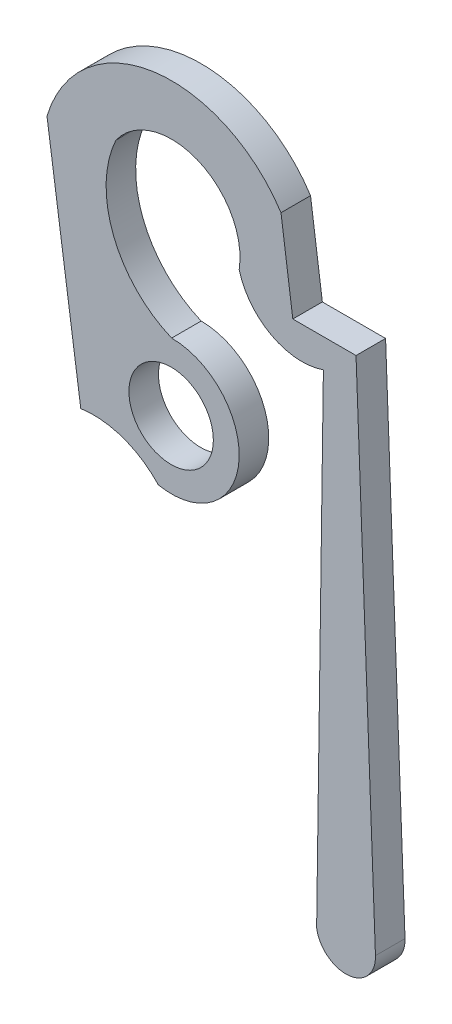
ISO-10303-21;
HEADER;
FILE_DESCRIPTION(('STEP AP214'),'2;1');
FILE_NAME('part.step','',(''),(''),'','','');
FILE_SCHEMA(('AUTOMOTIVE_DESIGN { 1 0 10303 214 1 1 1 1 }'));
ENDSEC;
DATA;
#1=APPLICATION_CONTEXT('core data for automotive mechanical design processes');
#2=APPLICATION_PROTOCOL_DEFINITION('international standard','automotive_design',2000,#1);
#3=PRODUCT_CONTEXT('',#1,'mechanical');
#4=PRODUCT('Part','Part','',(#3));
#5=PRODUCT_RELATED_PRODUCT_CATEGORY('part','',(#4));
#6=PRODUCT_DEFINITION_FORMATION('','',#4);
#7=PRODUCT_DEFINITION_CONTEXT('part definition',#1,'design');
#8=PRODUCT_DEFINITION('design','',#6,#7);
#9=PRODUCT_DEFINITION_SHAPE('','',#8);
#10=(LENGTH_UNIT() NAMED_UNIT(*) SI_UNIT(.MILLI.,.METRE.));
#11=(NAMED_UNIT(*) PLANE_ANGLE_UNIT() SI_UNIT($,.RADIAN.));
#12=(NAMED_UNIT(*) SI_UNIT($,.STERADIAN.) SOLID_ANGLE_UNIT());
#13=UNCERTAINTY_MEASURE_WITH_UNIT(LENGTH_MEASURE(1.E-05),#10,'distance_accuracy_value','');
#14=(GEOMETRIC_REPRESENTATION_CONTEXT(3) GLOBAL_UNCERTAINTY_ASSIGNED_CONTEXT((#13)) GLOBAL_UNIT_ASSIGNED_CONTEXT((#10,
#11,#12)) REPRESENTATION_CONTEXT('',''));
#15=CARTESIAN_POINT('',(0.,0.,0.));
#16=DIRECTION('',(0.,0.,1.));
#17=DIRECTION('',(1.,0.,0.));
#18=AXIS2_PLACEMENT_3D('',#15,#16,#17);
#19=CARTESIAN_POINT('',(-0.798867095389457,6.84712040475407,0.889));
#20=DIRECTION('',(0.,0.,1.));
#21=DIRECTION('',(1.,0.,0.));
#22=AXIS2_PLACEMENT_3D('',#19,#20,#21);
#23=PLANE('',#22);
#24=CARTESIAN_POINT('',(-0.798867095389457,6.84712040475407,0.889));
#25=DIRECTION('',(0.,0.,1.));
#26=DIRECTION('',(1.,0.,0.));
#27=AXIS2_PLACEMENT_3D('',#24,#25,#26);
#28=CIRCLE('',#27,3.9116);
#29=CARTESIAN_POINT('',(2.4905857332775,8.96374853647088,0.889));
#30=VERTEX_POINT('',#29);
#31=CARTESIAN_POINT('',(-4.54799336826929,7.96276674208602,0.889));
#32=VERTEX_POINT('',#31);
#33=EDGE_CURVE('E206',#30,#32,#28,.T.);
#34=ORIENTED_EDGE('',*,*,#33,.T.);
#35=DIRECTION('',(0.14142135623731,-0.989949493661167,0.));
#36=VECTOR('',#35,1.);
#37=CARTESIAN_POINT('',(-4.54799336826929,7.96276674208602,0.889));
#38=LINE('',#37,#36);
#39=CARTESIAN_POINT('',(-3.53199336826929,0.85076674208602,0.889));
#40=VERTEX_POINT('',#39);
#41=EDGE_CURVE('E116',#32,#40,#38,.T.);
#42=ORIENTED_EDGE('',*,*,#41,.T.);
#43=CARTESIAN_POINT('',(-3.15099964941024,-1.78887959524593,0.889));
#44=DIRECTION('',(0.,0.,-1.));
#45=DIRECTION('',(-1.,0.,0.));
#46=AXIS2_PLACEMENT_3D('',#43,#44,#45);
#47=CIRCLE('',#46,2.667);
#48=CARTESIAN_POINT('',(-1.19955430017328,0.029017555019018,0.889));
#49=VERTEX_POINT('',#48);
#50=EDGE_CURVE('E245',#40,#49,#47,.T.);
#51=ORIENTED_EDGE('',*,*,#50,.T.);
#52=CARTESIAN_POINT('',(-0.798867095389457,2.02112040475407,0.889));
#53=DIRECTION('',(0.,0.,1.));
#54=DIRECTION('',(1.,0.,0.));
#55=AXIS2_PLACEMENT_3D('',#52,#53,#54);
#56=CIRCLE('',#55,2.032);
#57=CARTESIAN_POINT('',(-0.798867095389457,4.05312040475407,0.889));
#58=VERTEX_POINT('',#57);
#59=EDGE_CURVE('E265',#49,#58,#56,.T.);
#60=ORIENTED_EDGE('',*,*,#59,.T.);
#61=CARTESIAN_POINT('',(0.455800350589755,7.02492040475407,0.889));
#62=DIRECTION('',(0.,0.,-1.));
#63=DIRECTION('',(-1.,0.,0.));
#64=AXIS2_PLACEMENT_3D('',#61,#62,#63);
#65=CIRCLE('',#64,3.2258);
#66=CARTESIAN_POINT('',(-2.47780803733641,8.36645962009191,0.889));
#67=VERTEX_POINT('',#66);
#68=EDGE_CURVE('E261',#58,#67,#65,.T.);
#69=ORIENTED_EDGE('',*,*,#68,.T.);
#70=CARTESIAN_POINT('',(-0.798867095389457,7.17732040475407,0.889));
#71=DIRECTION('',(0.,0.,-1.));
#72=DIRECTION('',(-1.,0.,0.));
#73=AXIS2_PLACEMENT_3D('',#70,#71,#72);
#74=CIRCLE('',#73,2.0574);
#75=CARTESIAN_POINT('',(1.23271401798742,6.85240050728645,0.889));
#76=VERTEX_POINT('',#75);
#77=EDGE_CURVE('E264',#67,#76,#74,.T.);
#78=ORIENTED_EDGE('',*,*,#77,.T.);
#79=CARTESIAN_POINT('',(3.12280035058975,7.35512040475407,0.889));
#80=DIRECTION('',(0.,0.,1.));
#81=DIRECTION('',(1.,0.,0.));
#82=AXIS2_PLACEMENT_3D('',#79,#80,#81);
#83=CIRCLE('',#82,1.9558);
#84=CARTESIAN_POINT('',(3.76591481255984,5.50808022413944,0.889));
#85=VERTEX_POINT('',#84);
#86=EDGE_CURVE('E271',#76,#85,#83,.T.);
#87=ORIENTED_EDGE('',*,*,#86,.T.);
#88=DIRECTION('',(-0.0138875494907576,-0.999903563334556,0.));
#89=VECTOR('',#88,1.);
#90=CARTESIAN_POINT('',(3.76591481255984,5.50808022413944,0.889));
#91=LINE('',#90,#89);
#92=CARTESIAN_POINT('',(3.56271481255984,-9.12231977586055,0.889));
#93=VERTEX_POINT('',#92);
#94=EDGE_CURVE('E278',#85,#93,#91,.T.);
#95=ORIENTED_EDGE('',*,*,#94,.T.);
#96=CARTESIAN_POINT('',(4.44360035058976,-9.00247959524593,0.889));
#97=DIRECTION('',(0.,0.,1.));
#98=DIRECTION('',(1.,0.,0.));
#99=AXIS2_PLACEMENT_3D('',#96,#97,#98);
#100=CIRCLE('',#99,0.889);
#101=CARTESIAN_POINT('',(5.33195650523977,-8.96865146352912,0.889));
#102=VERTEX_POINT('',#101);
#103=EDGE_CURVE('E147',#93,#102,#100,.T.);
#104=ORIENTED_EDGE('',*,*,#103,.T.);
#105=DIRECTION('',(-0.0380518916949438,0.999275764510696,0.));
#106=VECTOR('',#105,1.);
#107=CARTESIAN_POINT('',(4.74775650523976,6.37294853647088,0.889));
#108=LINE('',#107,#106);
#109=CARTESIAN_POINT('',(4.74775650523976,6.37294853647088,0.889));
#110=VERTEX_POINT('',#109);
#111=EDGE_CURVE('E141',#102,#110,#108,.T.);
#112=ORIENTED_EDGE('',*,*,#111,.T.);
#113=DIRECTION('',(-1.,0.,0.));
#114=VECTOR('',#113,1.);
#115=CARTESIAN_POINT('',(2.8461857332775,6.37294853647088,0.889));
#116=LINE('',#115,#114);
#117=CARTESIAN_POINT('',(2.8461857332775,6.37294853647088,0.889));
#118=VERTEX_POINT('',#117);
#119=EDGE_CURVE('E145',#110,#118,#116,.T.);
#120=ORIENTED_EDGE('',*,*,#119,.T.);
#121=DIRECTION('',(-0.135980020730017,0.990711579604409,0.));
#122=VECTOR('',#121,1.);
#123=CARTESIAN_POINT('',(2.4905857332775,8.96374853647088,0.889));
#124=LINE('',#123,#122);
#125=EDGE_CURVE('E61',#118,#30,#124,.T.);
#126=ORIENTED_EDGE('',*,*,#125,.T.);
#127=EDGE_LOOP('',(#34,#42,#51,#60,#69,#78,#87,#95,#104,#112,#120,#126));
#128=FACE_BOUND('',#127,.T.);
#129=CARTESIAN_POINT('',(-0.814199649410244,2.02112040475407,0.889));
#130=DIRECTION('',(0.,0.,1.));
#131=DIRECTION('',(1.,0.,0.));
#132=AXIS2_PLACEMENT_3D('',#129,#130,#131);
#133=CIRCLE('',#132,1.27);
#134=CARTESIAN_POINT('',(0.455800350589756,2.02112040475407,0.889));
#135=VERTEX_POINT('',#134);
#136=EDGE_CURVE('E176',#135,#135,#133,.T.);
#137=ORIENTED_EDGE('',*,*,#136,.F.);
#138=EDGE_LOOP('',(#137));
#139=FACE_BOUND('',#138,.T.);
#140=ADVANCED_FACE('F43',(#128,#139),#23,.T.);
#141=CARTESIAN_POINT('',(-0.798867095389457,6.84712040475407,0.));
#142=DIRECTION('',(0.,0.,1.));
#143=DIRECTION('',(1.,0.,0.));
#144=AXIS2_PLACEMENT_3D('',#141,#142,#143);
#145=PLANE('',#144);
#146=CARTESIAN_POINT('',(-0.798867095389457,6.84712040475407,0.));
#147=DIRECTION('',(0.,0.,1.));
#148=DIRECTION('',(1.,0.,0.));
#149=AXIS2_PLACEMENT_3D('',#146,#147,#148);
#150=CIRCLE('',#149,3.9116);
#151=CARTESIAN_POINT('',(2.4905857332775,8.96374853647088,0.));
#152=VERTEX_POINT('',#151);
#153=CARTESIAN_POINT('',(-4.54799336826929,7.96276674208602,0.));
#154=VERTEX_POINT('',#153);
#155=EDGE_CURVE('E171',#152,#154,#150,.T.);
#156=ORIENTED_EDGE('',*,*,#155,.F.);
#157=DIRECTION('',(-0.135980020730017,0.990711579604409,0.));
#158=VECTOR('',#157,1.);
#159=CARTESIAN_POINT('',(2.4905857332775,8.96374853647088,0.));
#160=LINE('',#159,#158);
#161=CARTESIAN_POINT('',(2.8461857332775,6.37294853647088,0.));
#162=VERTEX_POINT('',#161);
#163=EDGE_CURVE('E108',#162,#152,#160,.T.);
#164=ORIENTED_EDGE('',*,*,#163,.F.);
#165=DIRECTION('',(-1.,0.,0.));
#166=VECTOR('',#165,1.);
#167=CARTESIAN_POINT('',(2.8461857332775,6.37294853647088,0.));
#168=LINE('',#167,#166);
#169=CARTESIAN_POINT('',(4.74775650523976,6.37294853647088,0.));
#170=VERTEX_POINT('',#169);
#171=EDGE_CURVE('E102',#170,#162,#168,.T.);
#172=ORIENTED_EDGE('',*,*,#171,.F.);
#173=DIRECTION('',(-0.0380518916949438,0.999275764510696,0.));
#174=VECTOR('',#173,1.);
#175=CARTESIAN_POINT('',(4.74775650523976,6.37294853647088,0.));
#176=LINE('',#175,#174);
#177=CARTESIAN_POINT('',(5.33195650523977,-8.96865146352912,0.));
#178=VERTEX_POINT('',#177);
#179=EDGE_CURVE('E156',#178,#170,#176,.T.);
#180=ORIENTED_EDGE('',*,*,#179,.F.);
#181=CARTESIAN_POINT('',(4.44360035058976,-9.00247959524593,0.));
#182=DIRECTION('',(0.,0.,1.));
#183=DIRECTION('',(1.,0.,0.));
#184=AXIS2_PLACEMENT_3D('',#181,#182,#183);
#185=CIRCLE('',#184,0.889);
#186=CARTESIAN_POINT('',(3.56271481255984,-9.12231977586055,0.));
#187=VERTEX_POINT('',#186);
#188=EDGE_CURVE('E197',#187,#178,#185,.T.);
#189=ORIENTED_EDGE('',*,*,#188,.F.);
#190=DIRECTION('',(-0.0138875494907576,-0.999903563334556,0.));
#191=VECTOR('',#190,1.);
#192=CARTESIAN_POINT('',(3.76591481255984,5.50808022413944,0.));
#193=LINE('',#192,#191);
#194=CARTESIAN_POINT('',(3.76591481255984,5.50808022413944,0.));
#195=VERTEX_POINT('',#194);
#196=EDGE_CURVE('E194',#195,#187,#193,.T.);
#197=ORIENTED_EDGE('',*,*,#196,.F.);
#198=CARTESIAN_POINT('',(3.12280035058975,7.35512040475407,0.));
#199=DIRECTION('',(0.,0.,1.));
#200=DIRECTION('',(1.,0.,0.));
#201=AXIS2_PLACEMENT_3D('',#198,#199,#200);
#202=CIRCLE('',#201,1.9558);
#203=CARTESIAN_POINT('',(1.23271401798742,6.85240050728645,0.));
#204=VERTEX_POINT('',#203);
#205=EDGE_CURVE('E191',#204,#195,#202,.T.);
#206=ORIENTED_EDGE('',*,*,#205,.F.);
#207=CARTESIAN_POINT('',(-0.798867095389457,7.17732040475407,0.));
#208=DIRECTION('',(0.,0.,-1.));
#209=DIRECTION('',(-1.,0.,0.));
#210=AXIS2_PLACEMENT_3D('',#207,#208,#209);
#211=CIRCLE('',#210,2.0574);
#212=CARTESIAN_POINT('',(-2.47780803733641,8.36645962009191,0.));
#213=VERTEX_POINT('',#212);
#214=EDGE_CURVE('E188',#213,#204,#211,.T.);
#215=ORIENTED_EDGE('',*,*,#214,.F.);
#216=CARTESIAN_POINT('',(0.455800350589755,7.02492040475407,0.));
#217=DIRECTION('',(0.,0.,-1.));
#218=DIRECTION('',(-1.,0.,0.));
#219=AXIS2_PLACEMENT_3D('',#216,#217,#218);
#220=CIRCLE('',#219,3.2258);
#221=CARTESIAN_POINT('',(-0.798867095389457,4.05312040475407,0.));
#222=VERTEX_POINT('',#221);
#223=EDGE_CURVE('E185',#222,#213,#220,.T.);
#224=ORIENTED_EDGE('',*,*,#223,.F.);
#225=CARTESIAN_POINT('',(-0.798867095389457,2.02112040475407,0.));
#226=DIRECTION('',(0.,0.,1.));
#227=DIRECTION('',(1.,0.,0.));
#228=AXIS2_PLACEMENT_3D('',#225,#226,#227);
#229=CIRCLE('',#228,2.032);
#230=CARTESIAN_POINT('',(-1.19955430017328,0.029017555019018,0.));
#231=VERTEX_POINT('',#230);
#232=EDGE_CURVE('E182',#231,#222,#229,.T.);
#233=ORIENTED_EDGE('',*,*,#232,.F.);
#234=CARTESIAN_POINT('',(-3.15099964941024,-1.78887959524593,0.));
#235=DIRECTION('',(0.,0.,-1.));
#236=DIRECTION('',(-1.,0.,0.));
#237=AXIS2_PLACEMENT_3D('',#234,#235,#236);
#238=CIRCLE('',#237,2.667);
#239=CARTESIAN_POINT('',(-3.53199336826929,0.85076674208602,0.));
#240=VERTEX_POINT('',#239);
#241=EDGE_CURVE('E179',#240,#231,#238,.T.);
#242=ORIENTED_EDGE('',*,*,#241,.F.);
#243=DIRECTION('',(0.14142135623731,-0.989949493661167,0.));
#244=VECTOR('',#243,1.);
#245=CARTESIAN_POINT('',(-4.54799336826929,7.96276674208602,0.));
#246=LINE('',#245,#244);
#247=EDGE_CURVE('E175',#154,#240,#246,.T.);
#248=ORIENTED_EDGE('',*,*,#247,.F.);
#249=EDGE_LOOP('',(#156,#164,#172,#180,#189,#197,#206,#215,#224,#233,#242,#248));
#250=FACE_BOUND('',#249,.T.);
#251=CARTESIAN_POINT('',(-0.814199649410244,2.02112040475407,0.));
#252=DIRECTION('',(0.,0.,1.));
#253=DIRECTION('',(1.,0.,0.));
#254=AXIS2_PLACEMENT_3D('',#251,#252,#253);
#255=CIRCLE('',#254,1.27);
#256=CARTESIAN_POINT('',(0.455800350589756,2.02112040475407,0.));
#257=VERTEX_POINT('',#256);
#258=EDGE_CURVE('E332',#257,#257,#255,.T.);
#259=ORIENTED_EDGE('',*,*,#258,.T.);
#260=EDGE_LOOP('',(#259));
#261=FACE_BOUND('',#260,.T.);
#262=ADVANCED_FACE('F249',(#250,#261),#145,.F.);
#263=CARTESIAN_POINT('',(-0.798867095389457,6.84712040475407,0.889));
#264=DIRECTION('',(0.,0.,-1.));
#265=DIRECTION('',(-1.,0.,0.));
#266=AXIS2_PLACEMENT_3D('',#263,#264,#265);
#267=CYLINDRICAL_SURFACE('',#266,3.9116);
#268=ORIENTED_EDGE('',*,*,#155,.T.);
#269=DIRECTION('',(0.,0.,-1.));
#270=VECTOR('',#269,1.);
#271=CARTESIAN_POINT('',(-4.54799336826929,7.96276674208602,0.889));
#272=LINE('',#271,#270);
#273=EDGE_CURVE('E11',#32,#154,#272,.T.);
#274=ORIENTED_EDGE('',*,*,#273,.F.);
#275=ORIENTED_EDGE('',*,*,#33,.F.);
#276=DIRECTION('',(0.,0.,-1.));
#277=VECTOR('',#276,1.);
#278=CARTESIAN_POINT('',(2.4905857332775,8.96374853647088,0.889));
#279=LINE('',#278,#277);
#280=EDGE_CURVE('E167',#30,#152,#279,.T.);
#281=ORIENTED_EDGE('',*,*,#280,.T.);
#282=EDGE_LOOP('',(#268,#274,#275,#281));
#283=FACE_BOUND('',#282,.T.);
#284=ADVANCED_FACE('F45',(#283),#267,.T.);
#285=CARTESIAN_POINT('',(-4.54799336826929,7.96276674208602,0.889));
#286=DIRECTION('',(0.989949493661167,0.14142135623731,0.));
#287=DIRECTION('',(-0.14142135623731,0.989949493661167,0.));
#288=AXIS2_PLACEMENT_3D('',#285,#286,#287);
#289=PLANE('',#288);
#290=ORIENTED_EDGE('',*,*,#247,.T.);
#291=DIRECTION('',(0.,0.,-1.));
#292=VECTOR('',#291,1.);
#293=CARTESIAN_POINT('',(-3.53199336826929,0.85076674208602,0.889));
#294=LINE('',#293,#292);
#295=EDGE_CURVE('E53',#40,#240,#294,.T.);
#296=ORIENTED_EDGE('',*,*,#295,.F.);
#297=ORIENTED_EDGE('',*,*,#41,.F.);
#298=ORIENTED_EDGE('',*,*,#273,.T.);
#299=EDGE_LOOP('',(#290,#296,#297,#298));
#300=FACE_BOUND('',#299,.T.);
#301=ADVANCED_FACE('F382',(#300),#289,.F.);
#302=CARTESIAN_POINT('',(-3.15099964941024,-1.78887959524593,0.889));
#303=DIRECTION('',(0.,0.,-1.));
#304=DIRECTION('',(-1.,0.,0.));
#305=AXIS2_PLACEMENT_3D('',#302,#303,#304);
#306=CYLINDRICAL_SURFACE('',#305,2.667);
#307=ORIENTED_EDGE('',*,*,#241,.T.);
#308=DIRECTION('',(0.,0.,-1.));
#309=VECTOR('',#308,1.);
#310=CARTESIAN_POINT('',(-1.19955430017328,0.029017555019018,0.889));
#311=LINE('',#310,#309);
#312=EDGE_CURVE('E233',#49,#231,#311,.T.);
#313=ORIENTED_EDGE('',*,*,#312,.F.);
#314=ORIENTED_EDGE('',*,*,#50,.F.);
#315=ORIENTED_EDGE('',*,*,#295,.T.);
#316=EDGE_LOOP('',(#307,#313,#314,#315));
#317=FACE_BOUND('',#316,.T.);
#318=ADVANCED_FACE('F243',(#317),#306,.F.);
#319=CARTESIAN_POINT('',(-0.798867095389457,2.02112040475407,0.889));
#320=DIRECTION('',(0.,0.,-1.));
#321=DIRECTION('',(-1.,0.,0.));
#322=AXIS2_PLACEMENT_3D('',#319,#320,#321);
#323=CYLINDRICAL_SURFACE('',#322,2.032);
#324=ORIENTED_EDGE('',*,*,#232,.T.);
#325=DIRECTION('',(0.,0.,-1.));
#326=VECTOR('',#325,1.);
#327=CARTESIAN_POINT('',(-0.798867095389457,4.05312040475407,0.889));
#328=LINE('',#327,#326);
#329=EDGE_CURVE('E229',#58,#222,#328,.T.);
#330=ORIENTED_EDGE('',*,*,#329,.F.);
#331=ORIENTED_EDGE('',*,*,#59,.F.);
#332=ORIENTED_EDGE('',*,*,#312,.T.);
#333=EDGE_LOOP('',(#324,#330,#331,#332));
#334=FACE_BOUND('',#333,.T.);
#335=ADVANCED_FACE('F255',(#334),#323,.T.);
#336=CARTESIAN_POINT('',(0.455800350589755,7.02492040475407,0.889));
#337=DIRECTION('',(0.,0.,-1.));
#338=DIRECTION('',(-1.,0.,0.));
#339=AXIS2_PLACEMENT_3D('',#336,#337,#338);
#340=CYLINDRICAL_SURFACE('',#339,3.2258);
#341=ORIENTED_EDGE('',*,*,#223,.T.);
#342=DIRECTION('',(0.,0.,-1.));
#343=VECTOR('',#342,1.);
#344=CARTESIAN_POINT('',(-2.47780803733641,8.36645962009191,0.889));
#345=LINE('',#344,#343);
#346=EDGE_CURVE('E225',#67,#213,#345,.T.);
#347=ORIENTED_EDGE('',*,*,#346,.F.);
#348=ORIENTED_EDGE('',*,*,#68,.F.);
#349=ORIENTED_EDGE('',*,*,#329,.T.);
#350=EDGE_LOOP('',(#341,#347,#348,#349));
#351=FACE_BOUND('',#350,.T.);
#352=ADVANCED_FACE('F259',(#351),#340,.F.);
#353=CARTESIAN_POINT('',(-0.798867095389457,7.17732040475407,0.889));
#354=DIRECTION('',(0.,0.,-1.));
#355=DIRECTION('',(-1.,0.,0.));
#356=AXIS2_PLACEMENT_3D('',#353,#354,#355);
#357=CYLINDRICAL_SURFACE('',#356,2.0574);
#358=ORIENTED_EDGE('',*,*,#214,.T.);
#359=DIRECTION('',(0.,0.,-1.));
#360=VECTOR('',#359,1.);
#361=CARTESIAN_POINT('',(1.23271401798742,6.85240050728645,0.889));
#362=LINE('',#361,#360);
#363=EDGE_CURVE('E221',#76,#204,#362,.T.);
#364=ORIENTED_EDGE('',*,*,#363,.F.);
#365=ORIENTED_EDGE('',*,*,#77,.F.);
#366=ORIENTED_EDGE('',*,*,#346,.T.);
#367=EDGE_LOOP('',(#358,#364,#365,#366));
#368=FACE_BOUND('',#367,.T.);
#369=ADVANCED_FACE('F372',(#368),#357,.F.);
#370=CARTESIAN_POINT('',(3.12280035058975,7.35512040475407,0.889));
#371=DIRECTION('',(0.,0.,-1.));
#372=DIRECTION('',(-1.,0.,0.));
#373=AXIS2_PLACEMENT_3D('',#370,#371,#372);
#374=CYLINDRICAL_SURFACE('',#373,1.9558);
#375=ORIENTED_EDGE('',*,*,#205,.T.);
#376=DIRECTION('',(0.,0.,-1.));
#377=VECTOR('',#376,1.);
#378=CARTESIAN_POINT('',(3.76591481255984,5.50808022413944,0.889));
#379=LINE('',#378,#377);
#380=EDGE_CURVE('E217',#85,#195,#379,.T.);
#381=ORIENTED_EDGE('',*,*,#380,.F.);
#382=ORIENTED_EDGE('',*,*,#86,.F.);
#383=ORIENTED_EDGE('',*,*,#363,.T.);
#384=EDGE_LOOP('',(#375,#381,#382,#383));
#385=FACE_BOUND('',#384,.T.);
#386=ADVANCED_FACE('F368',(#385),#374,.T.);
#387=CARTESIAN_POINT('',(3.76591481255984,5.50808022413944,0.889));
#388=DIRECTION('',(0.999903563334556,-0.0138875494907576,0.));
#389=DIRECTION('',(0.0138875494907576,0.999903563334556,0.));
#390=AXIS2_PLACEMENT_3D('',#387,#388,#389);
#391=PLANE('',#390);
#392=ORIENTED_EDGE('',*,*,#196,.T.);
#393=DIRECTION('',(0.,0.,-1.));
#394=VECTOR('',#393,1.);
#395=CARTESIAN_POINT('',(3.56271481255984,-9.12231977586055,0.889));
#396=LINE('',#395,#394);
#397=EDGE_CURVE('E213',#93,#187,#396,.T.);
#398=ORIENTED_EDGE('',*,*,#397,.F.);
#399=ORIENTED_EDGE('',*,*,#94,.F.);
#400=ORIENTED_EDGE('',*,*,#380,.T.);
#401=EDGE_LOOP('',(#392,#398,#399,#400));
#402=FACE_BOUND('',#401,.T.);
#403=ADVANCED_FACE('F364',(#402),#391,.F.);
#404=CARTESIAN_POINT('',(4.44360035058976,-9.00247959524593,0.889));
#405=DIRECTION('',(0.,0.,-1.));
#406=DIRECTION('',(-1.,0.,0.));
#407=AXIS2_PLACEMENT_3D('',#404,#405,#406);
#408=CYLINDRICAL_SURFACE('',#407,0.889);
#409=ORIENTED_EDGE('',*,*,#188,.T.);
#410=DIRECTION('',(0.,0.,-1.));
#411=VECTOR('',#410,1.);
#412=CARTESIAN_POINT('',(5.33195650523977,-8.96865146352912,0.889));
#413=LINE('',#412,#411);
#414=EDGE_CURVE('E158',#102,#178,#413,.T.);
#415=ORIENTED_EDGE('',*,*,#414,.F.);
#416=ORIENTED_EDGE('',*,*,#103,.F.);
#417=ORIENTED_EDGE('',*,*,#397,.T.);
#418=EDGE_LOOP('',(#409,#415,#416,#417));
#419=FACE_BOUND('',#418,.T.);
#420=ADVANCED_FACE('F361',(#419),#408,.T.);
#421=CARTESIAN_POINT('',(4.74775650523976,6.37294853647088,0.889));
#422=DIRECTION('',(-0.999275764510696,-0.0380518916949438,0.));
#423=DIRECTION('',(0.0380518916949438,-0.999275764510696,0.));
#424=AXIS2_PLACEMENT_3D('',#421,#422,#423);
#425=PLANE('',#424);
#426=ORIENTED_EDGE('',*,*,#179,.T.);
#427=DIRECTION('',(0.,0.,-1.));
#428=VECTOR('',#427,1.);
#429=CARTESIAN_POINT('',(4.74775650523976,6.37294853647088,0.889));
#430=LINE('',#429,#428);
#431=EDGE_CURVE('E153',#110,#170,#430,.T.);
#432=ORIENTED_EDGE('',*,*,#431,.F.);
#433=ORIENTED_EDGE('',*,*,#111,.F.);
#434=ORIENTED_EDGE('',*,*,#414,.T.);
#435=EDGE_LOOP('',(#426,#432,#433,#434));
#436=FACE_BOUND('',#435,.T.);
#437=ADVANCED_FACE('F154',(#436),#425,.F.);
#438=CARTESIAN_POINT('',(2.8461857332775,6.37294853647088,0.889));
#439=DIRECTION('',(0.,-1.,0.));
#440=DIRECTION('',(0.,0.,-1.));
#441=AXIS2_PLACEMENT_3D('',#438,#439,#440);
#442=PLANE('',#441);
#443=ORIENTED_EDGE('',*,*,#171,.T.);
#444=DIRECTION('',(0.,0.,-1.));
#445=VECTOR('',#444,1.);
#446=CARTESIAN_POINT('',(2.8461857332775,6.37294853647088,0.889));
#447=LINE('',#446,#445);
#448=EDGE_CURVE('E159',#118,#162,#447,.T.);
#449=ORIENTED_EDGE('',*,*,#448,.F.);
#450=ORIENTED_EDGE('',*,*,#119,.F.);
#451=ORIENTED_EDGE('',*,*,#431,.T.);
#452=EDGE_LOOP('',(#443,#449,#450,#451));
#453=FACE_BOUND('',#452,.T.);
#454=ADVANCED_FACE('F161',(#453),#442,.F.);
#455=CARTESIAN_POINT('',(2.4905857332775,8.96374853647088,0.889));
#456=DIRECTION('',(-0.99071157960441,-0.135980020730017,0.));
#457=DIRECTION('',(0.135980020730017,-0.99071157960441,0.));
#458=AXIS2_PLACEMENT_3D('',#455,#456,#457);
#459=PLANE('',#458);
#460=ORIENTED_EDGE('',*,*,#163,.T.);
#461=ORIENTED_EDGE('',*,*,#280,.F.);
#462=ORIENTED_EDGE('',*,*,#125,.F.);
#463=ORIENTED_EDGE('',*,*,#448,.T.);
#464=EDGE_LOOP('',(#460,#461,#462,#463));
#465=FACE_BOUND('',#464,.T.);
#466=ADVANCED_FACE('F343',(#465),#459,.F.);
#467=CARTESIAN_POINT('',(-0.814199649410244,2.02112040475407,0.889));
#468=DIRECTION('',(0.,0.,-1.));
#469=DIRECTION('',(-1.,0.,0.));
#470=AXIS2_PLACEMENT_3D('',#467,#468,#469);
#471=CYLINDRICAL_SURFACE('',#470,1.27);
#472=ORIENTED_EDGE('',*,*,#136,.T.);
#473=EDGE_LOOP('',(#472));
#474=FACE_BOUND('',#473,.T.);
#475=ORIENTED_EDGE('',*,*,#258,.F.);
#476=EDGE_LOOP('',(#475));
#477=FACE_BOUND('',#476,.T.);
#478=ADVANCED_FACE('F341',(#474,#477),#471,.F.);
#479=CLOSED_SHELL('',(#140,#262,#284,#301,#318,#335,#352,#369,#386,#403,#420,#437,#454,#466,#478));
#480=MANIFOLD_SOLID_BREP('B2',#479);
#481=ADVANCED_BREP_SHAPE_REPRESENTATION('',(#18,#480),#14);
#482=SHAPE_DEFINITION_REPRESENTATION(#9,#481);
ENDSEC;
END-ISO-10303-21;
